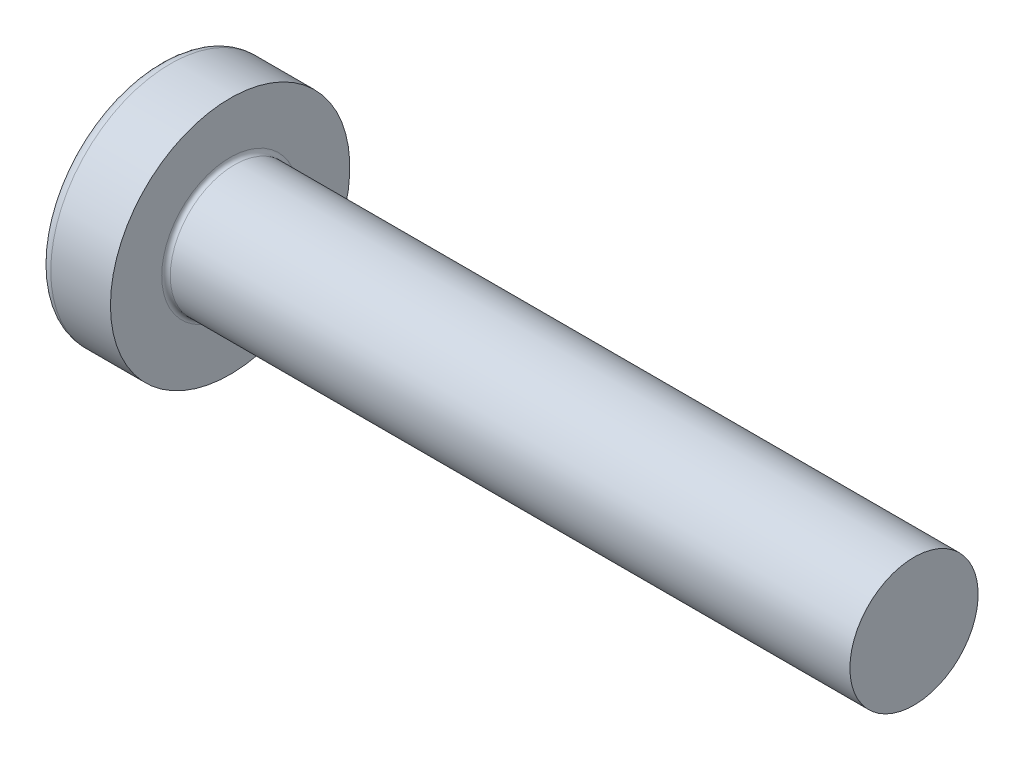
ISO-10303-21;
HEADER;
FILE_DESCRIPTION(('STEP AP214'),'2;1');
FILE_NAME('part.step','',(''),(''),'','','');
FILE_SCHEMA(('AUTOMOTIVE_DESIGN { 1 0 10303 214 1 1 1 1 }'));
ENDSEC;
DATA;
#1=APPLICATION_CONTEXT('core data for automotive mechanical design processes');
#2=APPLICATION_PROTOCOL_DEFINITION('international standard','automotive_design',2000,#1);
#3=PRODUCT_CONTEXT('',#1,'mechanical');
#4=PRODUCT('Part','Part','',(#3));
#5=PRODUCT_RELATED_PRODUCT_CATEGORY('part','',(#4));
#6=PRODUCT_DEFINITION_FORMATION('','',#4);
#7=PRODUCT_DEFINITION_CONTEXT('part definition',#1,'design');
#8=PRODUCT_DEFINITION('design','',#6,#7);
#9=PRODUCT_DEFINITION_SHAPE('','',#8);
#10=(LENGTH_UNIT() NAMED_UNIT(*) SI_UNIT(.MILLI.,.METRE.));
#11=(NAMED_UNIT(*) PLANE_ANGLE_UNIT() SI_UNIT($,.RADIAN.));
#12=(NAMED_UNIT(*) SI_UNIT($,.STERADIAN.) SOLID_ANGLE_UNIT());
#13=UNCERTAINTY_MEASURE_WITH_UNIT(LENGTH_MEASURE(1.E-05),#10,'distance_accuracy_value','');
#14=(GEOMETRIC_REPRESENTATION_CONTEXT(3) GLOBAL_UNCERTAINTY_ASSIGNED_CONTEXT((#13)) GLOBAL_UNIT_ASSIGNED_CONTEXT((#10,
#11,#12)) REPRESENTATION_CONTEXT('',''));
#15=CARTESIAN_POINT('',(0.,0.,0.));
#16=DIRECTION('',(0.,0.,1.));
#17=DIRECTION('',(1.,0.,0.));
#18=AXIS2_PLACEMENT_3D('',#15,#16,#17);
#19=CARTESIAN_POINT('',(5.,0.,0.));
#20=DIRECTION('',(-1.,0.,0.));
#21=DIRECTION('',(0.,1.,0.));
#22=AXIS2_PLACEMENT_3D('',#19,#20,#21);
#23=SPHERICAL_SURFACE('',#22,5.);
#24=CARTESIAN_POINT('',(0.775371598933733,0.,0.));
#25=DIRECTION('',(-1.,0.,0.));
#26=DIRECTION('',(0.,0.,1.));
#27=AXIS2_PLACEMENT_3D('',#24,#25,#26);
#28=CIRCLE('',#27,2.67441860465116);
#29=CARTESIAN_POINT('',(0.775371598933733,0.,2.67441860465116));
#30=VERTEX_POINT('',#29);
#31=EDGE_CURVE('E238',#30,#30,#28,.T.);
#32=ORIENTED_EDGE('',*,*,#31,.T.);
#33=EDGE_LOOP('',(#32));
#34=FACE_BOUND('',#33,.T.);
#35=CARTESIAN_POINT('',(0.0457951200896417,0.,0.));
#36=DIRECTION('',(1.,0.,0.));
#37=DIRECTION('',(0.,0.,-1.));
#38=AXIS2_PLACEMENT_3D('',#35,#36,#37);
#39=CIRCLE('',#38,0.675169614150692);
#40=CARTESIAN_POINT('',(0.0457951200896426,-0.369999999999998,-0.564760133040918));
#41=VERTEX_POINT('',#40);
#42=CARTESIAN_POINT('',(0.0457951200896417,-0.564760133040915,-0.37));
#43=VERTEX_POINT('',#42);
#44=EDGE_CURVE('E374',#41,#43,#39,.F.);
#45=ORIENTED_EDGE('',*,*,#44,.F.);
#46=CARTESIAN_POINT('',(5.,-0.37,0.));
#47=DIRECTION('',(0.,1.,0.));
#48=DIRECTION('',(0.,0.,1.));
#49=AXIS2_PLACEMENT_3D('',#46,#47,#48);
#50=CIRCLE('',#49,4.98629120689917);
#51=CARTESIAN_POINT('',(0.187869734228639,-0.369999999999995,-1.30633162146802));
#52=VERTEX_POINT('',#51);
#53=EDGE_CURVE('E300',#52,#41,#50,.T.);
#54=ORIENTED_EDGE('',*,*,#53,.F.);
#55=CARTESIAN_POINT('',(4.56358262530798,0.,0.875317983305919));
#56=DIRECTION('',(0.446197753347436,0.,-0.894934391398443));
#57=DIRECTION('',(-0.894934391398443,0.,-0.446197753347436));
#58=AXIS2_PLACEMENT_3D('',#55,#56,#57);
#59=CIRCLE('',#58,4.90340272700175);
#60=CARTESIAN_POINT('',(0.18786973422864,0.370000000000005,-1.30633162146802));
#61=VERTEX_POINT('',#60);
#62=EDGE_CURVE('E272',#52,#61,#59,.T.);
#63=ORIENTED_EDGE('',*,*,#62,.T.);
#64=CARTESIAN_POINT('',(5.,0.37,0.));
#65=DIRECTION('',(0.,-1.,0.));
#66=DIRECTION('',(0.,0.,-1.));
#67=AXIS2_PLACEMENT_3D('',#64,#65,#66);
#68=CIRCLE('',#67,4.98629120689917);
#69=CARTESIAN_POINT('',(0.0457951200896425,0.370000000000002,-0.564760133040916));
#70=VERTEX_POINT('',#69);
#71=EDGE_CURVE('E327',#70,#61,#68,.T.);
#72=ORIENTED_EDGE('',*,*,#71,.F.);
#73=CARTESIAN_POINT('',(0.0457951200896417,0.564760133040916,-0.37));
#74=VERTEX_POINT('',#73);
#75=EDGE_CURVE('E393',#74,#70,#39,.F.);
#76=ORIENTED_EDGE('',*,*,#75,.F.);
#77=CARTESIAN_POINT('',(5.,0.,-0.37));
#78=DIRECTION('',(0.,0.,1.));
#79=DIRECTION('',(1.,0.,0.));
#80=AXIS2_PLACEMENT_3D('',#77,#78,#79);
#81=CIRCLE('',#80,4.98629120689917);
#82=CARTESIAN_POINT('',(0.18786973422864,1.30633162146802,-0.37));
#83=VERTEX_POINT('',#82);
#84=EDGE_CURVE('E266',#83,#74,#81,.T.);
#85=ORIENTED_EDGE('',*,*,#84,.F.);
#86=CARTESIAN_POINT('',(4.56358262530798,-0.87531798330592,0.));
#87=DIRECTION('',(0.446197753347436,0.894934391398443,0.));
#88=DIRECTION('',(-0.894934391398442,0.446197753347436,0.));
#89=AXIS2_PLACEMENT_3D('',#86,#87,#88);
#90=CIRCLE('',#89,4.90340272700175);
#91=CARTESIAN_POINT('',(0.18786973422864,1.30633162146802,0.37));
#92=VERTEX_POINT('',#91);
#93=EDGE_CURVE('E269',#83,#92,#90,.T.);
#94=ORIENTED_EDGE('',*,*,#93,.T.);
#95=CARTESIAN_POINT('',(5.,0.,0.37));
#96=DIRECTION('',(0.,0.,-1.));
#97=DIRECTION('',(0.,1.,0.));
#98=AXIS2_PLACEMENT_3D('',#95,#96,#97);
#99=CIRCLE('',#98,4.98629120689917);
#100=CARTESIAN_POINT('',(0.0457951200896417,0.564760133040916,0.37));
#101=VERTEX_POINT('',#100);
#102=EDGE_CURVE('E262',#101,#92,#99,.T.);
#103=ORIENTED_EDGE('',*,*,#102,.F.);
#104=CARTESIAN_POINT('',(0.0457951200896434,0.369999999999998,0.564760133040918));
#105=VERTEX_POINT('',#104);
#106=EDGE_CURVE('E392',#105,#101,#39,.F.);
#107=ORIENTED_EDGE('',*,*,#106,.F.);
#108=CARTESIAN_POINT('',(0.18786973422864,0.369999999999995,1.30633162146802));
#109=VERTEX_POINT('',#108);
#110=EDGE_CURVE('E282',#109,#105,#68,.T.);
#111=ORIENTED_EDGE('',*,*,#110,.F.);
#112=CARTESIAN_POINT('',(4.56358262530798,0.,-0.87531798330592));
#113=DIRECTION('',(0.446197753347436,0.,0.894934391398443));
#114=DIRECTION('',(0.894934391398442,0.,-0.446197753347436));
#115=AXIS2_PLACEMENT_3D('',#112,#113,#114);
#116=CIRCLE('',#115,4.90340272700175);
#117=CARTESIAN_POINT('',(0.18786973422864,-0.370000000000005,1.30633162146802));
#118=VERTEX_POINT('',#117);
#119=EDGE_CURVE('E49',#109,#118,#116,.T.);
#120=ORIENTED_EDGE('',*,*,#119,.T.);
#121=CARTESIAN_POINT('',(0.0457951200896421,-0.370000000000002,0.564760133040916));
#122=VERTEX_POINT('',#121);
#123=EDGE_CURVE('E279',#122,#118,#50,.T.);
#124=ORIENTED_EDGE('',*,*,#123,.F.);
#125=CARTESIAN_POINT('',(0.0457951200896417,-0.564760133040916,0.37));
#126=VERTEX_POINT('',#125);
#127=EDGE_CURVE('E432',#126,#122,#39,.F.);
#128=ORIENTED_EDGE('',*,*,#127,.F.);
#129=CARTESIAN_POINT('',(0.187869734228639,-1.30633162146802,0.37));
#130=VERTEX_POINT('',#129);
#131=EDGE_CURVE('E263',#130,#126,#99,.T.);
#132=ORIENTED_EDGE('',*,*,#131,.F.);
#133=CARTESIAN_POINT('',(4.56358262530798,0.875317983305919,0.));
#134=DIRECTION('',(0.446197753347436,-0.894934391398443,0.));
#135=DIRECTION('',(0.894934391398443,0.446197753347436,0.));
#136=AXIS2_PLACEMENT_3D('',#133,#134,#135);
#137=CIRCLE('',#136,4.90340272700175);
#138=CARTESIAN_POINT('',(0.18786973422864,-1.30633162146802,-0.37));
#139=VERTEX_POINT('',#138);
#140=EDGE_CURVE('E259',#130,#139,#137,.T.);
#141=ORIENTED_EDGE('',*,*,#140,.T.);
#142=EDGE_CURVE('E64',#43,#139,#81,.T.);
#143=ORIENTED_EDGE('',*,*,#142,.F.);
#144=EDGE_LOOP('',(#45,#54,#63,#72,#76,#85,#94,#103,#107,#111,#120,#124,#128,#132,#141,#143));
#145=FACE_BOUND('',#144,.T.);
#146=ADVANCED_FACE('F35',(#34,#145),#23,.T.);
#147=CARTESIAN_POINT('',(1.75,0.527482331818931,-0.37));
#148=DIRECTION('',(0.,0.,1.));
#149=DIRECTION('',(1.,0.,0.));
#150=AXIS2_PLACEMENT_3D('',#147,#148,#149);
#151=PLANE('',#150);
#152=ORIENTED_EDGE('',*,*,#84,.T.);
#153=CARTESIAN_POINT('',(-0.987293237053716,0.649401255967161,-0.37));
#154=CARTESIAN_POINT('',(-0.781914975317084,0.632865887002871,-0.37));
#155=CARTESIAN_POINT('',(-0.576547882393372,0.616188977635081,-0.37));
#156=CARTESIAN_POINT('',(-0.165841599226327,0.582441031964227,-0.37));
#157=CARTESIAN_POINT('',(0.0394975903090452,0.56536998705488,-0.37));
#158=CARTESIAN_POINT('',(0.450133475422572,0.530723441326535,-0.37));
#159=CARTESIAN_POINT('',(0.655430171010573,0.513147940624557,-0.37));
#160=CARTESIAN_POINT('',(1.06596140177934,0.477314957985794,-0.37));
#161=CARTESIAN_POINT('',(1.2711959378071,0.459057485806066,-0.37));
#162=CARTESIAN_POINT('',(1.61065292365626,0.428051938688768,-0.37));
#163=CARTESIAN_POINT('',(1.74490059995643,0.415580824990931,-0.37));
#164=CARTESIAN_POINT('',(2.01334321762763,0.390092023404979,-0.37));
#165=CARTESIAN_POINT('',(2.14753815934577,0.377074339177353,-0.37));
#166=CARTESIAN_POINT('',(2.41586354151957,0.350315629452843,-0.37));
#167=CARTESIAN_POINT('',(2.5499939784531,0.33657456817765,-0.37));
#168=CARTESIAN_POINT('',(2.81814173295471,0.308004077741875,-0.37));
#169=CARTESIAN_POINT('',(2.95215904765134,0.293174621747065,-0.37));
#170=CARTESIAN_POINT('',(3.0860955068368,0.277618485071816,-0.37));
#171=B_SPLINE_CURVE_WITH_KNOTS('',3,(#153,#154,#155,#156,#157,#158,#159,#160,#161,#162,#163,
#164,#165,#166,#167,#168,#169,#170),.UNSPECIFIED.,.F.,.F.,(4,2,2,2,2,2,2,2,4),(0.,
0.618128793984691,1.23627109812525,1.85441325887562,2.4725465791681,2.87702276218609,
3.28149623678161,3.68598973550942,4.09049321032311),.UNSPECIFIED.);
#172=CARTESIAN_POINT('',(1.75,0.415013252800437,-0.37));
#173=VERTEX_POINT('',#172);
#174=EDGE_CURVE('E416',#74,#173,#171,.T.);
#175=ORIENTED_EDGE('',*,*,#174,.T.);
#176=DIRECTION('',(0.,1.,0.));
#177=VECTOR('',#176,1.);
#178=CARTESIAN_POINT('',(1.75,-0.527482331818931,-0.37));
#179=LINE('',#178,#177);
#180=CARTESIAN_POINT('',(1.75,0.527482331818931,-0.37));
#181=VERTEX_POINT('',#180);
#182=EDGE_CURVE('E356',#173,#181,#179,.T.);
#183=ORIENTED_EDGE('',*,*,#182,.T.);
#184=DIRECTION('',(0.894934391398442,-0.446197753347436,0.));
#185=VECTOR('',#184,1.);
#186=CARTESIAN_POINT('',(0.,1.4,-0.37));
#187=LINE('',#186,#185);
#188=EDGE_CURVE('E239',#83,#181,#187,.T.);
#189=ORIENTED_EDGE('',*,*,#188,.F.);
#190=EDGE_LOOP('',(#152,#175,#183,#189));
#191=FACE_BOUND('',#190,.T.);
#192=ADVANCED_FACE('F194',(#191),#151,.T.);
#193=CARTESIAN_POINT('',(1.75,-0.527482331818931,-0.37));
#194=VERTEX_POINT('',#193);
#195=CARTESIAN_POINT('',(1.75,-0.415013252800437,-0.37));
#196=VERTEX_POINT('',#195);
#197=EDGE_CURVE('E247',#194,#196,#179,.T.);
#198=ORIENTED_EDGE('',*,*,#197,.T.);
#199=CARTESIAN_POINT('',(-0.987293237053716,-0.649401255967161,-0.37));
#200=CARTESIAN_POINT('',(-0.781914975317084,-0.632865887002871,-0.37));
#201=CARTESIAN_POINT('',(-0.576547882393372,-0.616188977635081,-0.37));
#202=CARTESIAN_POINT('',(-0.165841599226327,-0.582441031964227,-0.37));
#203=CARTESIAN_POINT('',(0.0394975903090452,-0.56536998705488,-0.37));
#204=CARTESIAN_POINT('',(0.450133475422572,-0.530723441326535,-0.37));
#205=CARTESIAN_POINT('',(0.655430171010573,-0.513147940624557,-0.37));
#206=CARTESIAN_POINT('',(1.06596140177934,-0.477314957985794,-0.37));
#207=CARTESIAN_POINT('',(1.2711959378071,-0.459057485806066,-0.37));
#208=CARTESIAN_POINT('',(1.61065292365626,-0.428051938688768,-0.37));
#209=CARTESIAN_POINT('',(1.74490059995643,-0.415580824990931,-0.37));
#210=CARTESIAN_POINT('',(2.01334321762763,-0.390092023404979,-0.37));
#211=CARTESIAN_POINT('',(2.14753815934577,-0.377074339177353,-0.37));
#212=CARTESIAN_POINT('',(2.41586354151957,-0.350315629452843,-0.37));
#213=CARTESIAN_POINT('',(2.5499939784531,-0.33657456817765,-0.37));
#214=CARTESIAN_POINT('',(2.81814173295471,-0.308004077741875,-0.37));
#215=CARTESIAN_POINT('',(2.95215904765134,-0.293174621747065,-0.37));
#216=CARTESIAN_POINT('',(3.0860955068368,-0.277618485071816,-0.37));
#217=B_SPLINE_CURVE_WITH_KNOTS('',3,(#199,#200,#201,#202,#203,#204,#205,#206,#207,#208,#209,
#210,#211,#212,#213,#214,#215,#216),.UNSPECIFIED.,.F.,.F.,(4,2,2,2,2,2,2,2,4),(0.,
0.618128793984691,1.23627109812525,1.85441325887562,2.4725465791681,2.87702276218609,
3.28149623678161,3.68598973550942,4.09049321032311),.UNSPECIFIED.);
#218=EDGE_CURVE('E391',#196,#43,#217,.F.);
#219=ORIENTED_EDGE('',*,*,#218,.T.);
#220=ORIENTED_EDGE('',*,*,#142,.T.);
#221=DIRECTION('',(0.894934391398442,0.446197753347436,0.));
#222=VECTOR('',#221,1.);
#223=CARTESIAN_POINT('',(0.,-1.4,-0.37));
#224=LINE('',#223,#222);
#225=EDGE_CURVE('E330',#139,#194,#224,.T.);
#226=ORIENTED_EDGE('',*,*,#225,.T.);
#227=EDGE_LOOP('',(#198,#219,#220,#226));
#228=FACE_BOUND('',#227,.T.);
#229=ADVANCED_FACE('F200',(#228),#151,.T.);
#230=CARTESIAN_POINT('',(1.75,-0.527482331818931,0.37));
#231=DIRECTION('',(0.,0.,-1.));
#232=DIRECTION('',(0.,1.,0.));
#233=AXIS2_PLACEMENT_3D('',#230,#231,#232);
#234=PLANE('',#233);
#235=DIRECTION('',(0.,-1.,0.));
#236=VECTOR('',#235,1.);
#237=CARTESIAN_POINT('',(1.75,0.527482331818931,0.37));
#238=LINE('',#237,#236);
#239=CARTESIAN_POINT('',(1.75,0.527482331818931,0.37));
#240=VERTEX_POINT('',#239);
#241=CARTESIAN_POINT('',(1.75,0.415013252800437,0.37));
#242=VERTEX_POINT('',#241);
#243=EDGE_CURVE('E339',#240,#242,#238,.T.);
#244=ORIENTED_EDGE('',*,*,#243,.T.);
#245=CARTESIAN_POINT('',(-0.987293237069635,0.649401255968442,0.37));
#246=CARTESIAN_POINT('',(-0.781914975331301,0.632865887004023,0.37));
#247=CARTESIAN_POINT('',(-0.576547882405888,0.616188977636102,0.37));
#248=CARTESIAN_POINT('',(-0.16584159923544,0.582441031964983,0.37));
#249=CARTESIAN_POINT('',(0.0394975903016338,0.5653699870555,0.37));
#250=CARTESIAN_POINT('',(0.450133475420601,0.530723441326706,0.37));
#251=CARTESIAN_POINT('',(0.655430171012341,0.513147940624409,0.37));
#252=CARTESIAN_POINT('',(1.06596140178858,0.477314957984981,0.37));
#253=CARTESIAN_POINT('',(1.27119593782008,0.459057485804908,0.37));
#254=CARTESIAN_POINT('',(1.61065292367297,0.428051938687225,0.37));
#255=CARTESIAN_POINT('',(1.74490059997313,0.415580824989367,0.37));
#256=CARTESIAN_POINT('',(2.01334321764434,0.39009202340337,0.37));
#257=CARTESIAN_POINT('',(2.14753815936247,0.377074339175718,0.37));
#258=CARTESIAN_POINT('',(2.41586354153627,0.350315629451146,0.37));
#259=CARTESIAN_POINT('',(2.54999397846979,0.336574568175918,0.37));
#260=CARTESIAN_POINT('',(2.8181417329714,0.308004077740054,0.37));
#261=CARTESIAN_POINT('',(2.95215904766802,0.29317462174519,0.37));
#262=CARTESIAN_POINT('',(3.08609550685347,0.277618485069873,0.37));
#263=B_SPLINE_CURVE_WITH_KNOTS('',3,(#245,#246,#247,#248,#249,#250,#251,#252,#253,#254,#255,
#256,#257,#258,#259,#260,#261,#262),.UNSPECIFIED.,.F.,.F.,(4,2,2,2,2,2,2,2,4),(0.,
0.61812879398981,1.23627109813549,1.85441325889711,2.47254657920086,2.87702276221884,
3.28149623681436,3.68598973554218,4.09049321035586),.UNSPECIFIED.);
#264=EDGE_CURVE('E671',#242,#101,#263,.F.);
#265=ORIENTED_EDGE('',*,*,#264,.T.);
#266=ORIENTED_EDGE('',*,*,#102,.T.);
#267=DIRECTION('',(0.894934391398442,-0.446197753347436,0.));
#268=VECTOR('',#267,1.);
#269=CARTESIAN_POINT('',(0.,1.4,0.37));
#270=LINE('',#269,#268);
#271=EDGE_CURVE('E244',#92,#240,#270,.T.);
#272=ORIENTED_EDGE('',*,*,#271,.T.);
#273=EDGE_LOOP('',(#244,#265,#266,#272));
#274=FACE_BOUND('',#273,.T.);
#275=ADVANCED_FACE('F412',(#274),#234,.T.);
#276=ORIENTED_EDGE('',*,*,#131,.T.);
#277=CARTESIAN_POINT('',(-0.987293237069635,-0.649401255968442,0.37));
#278=CARTESIAN_POINT('',(-0.781914975331301,-0.632865887004023,0.37));
#279=CARTESIAN_POINT('',(-0.576547882405888,-0.616188977636102,0.37));
#280=CARTESIAN_POINT('',(-0.16584159923544,-0.582441031964983,0.37));
#281=CARTESIAN_POINT('',(0.0394975903016338,-0.5653699870555,0.37));
#282=CARTESIAN_POINT('',(0.450133475420601,-0.530723441326706,0.37));
#283=CARTESIAN_POINT('',(0.655430171012341,-0.513147940624409,0.37));
#284=CARTESIAN_POINT('',(1.06596140178858,-0.477314957984981,0.37));
#285=CARTESIAN_POINT('',(1.27119593782008,-0.459057485804908,0.37));
#286=CARTESIAN_POINT('',(1.61065292367297,-0.428051938687225,0.37));
#287=CARTESIAN_POINT('',(1.74490059997313,-0.415580824989367,0.37));
#288=CARTESIAN_POINT('',(2.01334321764434,-0.390092023403371,0.37));
#289=CARTESIAN_POINT('',(2.14753815936247,-0.377074339175718,0.37));
#290=CARTESIAN_POINT('',(2.41586354153627,-0.350315629451146,0.37));
#291=CARTESIAN_POINT('',(2.54999397846979,-0.336574568175918,0.37));
#292=CARTESIAN_POINT('',(2.8181417329714,-0.308004077740054,0.37));
#293=CARTESIAN_POINT('',(2.95215904766802,-0.29317462174519,0.37));
#294=CARTESIAN_POINT('',(3.08609550685347,-0.277618485069873,0.37));
#295=B_SPLINE_CURVE_WITH_KNOTS('',3,(#277,#278,#279,#280,#281,#282,#283,#284,#285,#286,#287,
#288,#289,#290,#291,#292,#293,#294),.UNSPECIFIED.,.F.,.F.,(4,2,2,2,2,2,2,2,4),(0.,
0.61812879398981,1.23627109813549,1.85441325889711,2.47254657920086,2.87702276221884,
3.28149623681436,3.68598973554218,4.09049321035586),.UNSPECIFIED.);
#296=CARTESIAN_POINT('',(1.75,-0.415013252800437,0.37));
#297=VERTEX_POINT('',#296);
#298=EDGE_CURVE('E433',#126,#297,#295,.T.);
#299=ORIENTED_EDGE('',*,*,#298,.T.);
#300=CARTESIAN_POINT('',(1.75,-0.527482331818932,0.37));
#301=VERTEX_POINT('',#300);
#302=EDGE_CURVE('E341',#297,#301,#238,.T.);
#303=ORIENTED_EDGE('',*,*,#302,.T.);
#304=DIRECTION('',(0.894934391398443,0.446197753347436,0.));
#305=VECTOR('',#304,1.);
#306=CARTESIAN_POINT('',(0.,-1.4,0.37));
#307=LINE('',#306,#305);
#308=EDGE_CURVE('E332',#130,#301,#307,.T.);
#309=ORIENTED_EDGE('',*,*,#308,.F.);
#310=EDGE_LOOP('',(#276,#299,#303,#309));
#311=FACE_BOUND('',#310,.T.);
#312=ADVANCED_FACE('F519',(#311),#234,.T.);
#313=CARTESIAN_POINT('',(1.75,0.527482331818931,0.37));
#314=DIRECTION('',(0.446197753347436,0.894934391398443,0.));
#315=DIRECTION('',(-0.894934391398442,0.446197753347436,0.));
#316=AXIS2_PLACEMENT_3D('',#313,#314,#315);
#317=PLANE('',#316);
#318=CARTESIAN_POINT('',(2.6696526882832,0.0689604923233249,0.));
#319=DIRECTION('',(0.446197753347436,0.894934391398443,0.));
#320=DIRECTION('',(-0.894934391398443,0.446197753347436,0.));
#321=AXIS2_PLACEMENT_3D('',#318,#319,#320);
#322=ELLIPSE('',#321,1.10195897609154,0.486831694838766);
#323=CARTESIAN_POINT('',(1.75,0.527482331818932,0.175779377683682));
#324=VERTEX_POINT('',#323);
#325=CARTESIAN_POINT('',(1.75,0.527482331818932,-0.175779377683682));
#326=VERTEX_POINT('',#325);
#327=EDGE_CURVE('E305',#324,#326,#322,.F.);
#328=ORIENTED_EDGE('',*,*,#327,.F.);
#329=DIRECTION('',(0.,0.,-1.));
#330=VECTOR('',#329,1.);
#331=CARTESIAN_POINT('',(1.75,0.527482331818931,0.37));
#332=LINE('',#331,#330);
#333=EDGE_CURVE('E342',#240,#324,#332,.T.);
#334=ORIENTED_EDGE('',*,*,#333,.F.);
#335=ORIENTED_EDGE('',*,*,#271,.F.);
#336=ORIENTED_EDGE('',*,*,#93,.F.);
#337=ORIENTED_EDGE('',*,*,#188,.T.);
#338=EDGE_CURVE('E344',#326,#181,#332,.T.);
#339=ORIENTED_EDGE('',*,*,#338,.F.);
#340=EDGE_LOOP('',(#328,#334,#335,#336,#337,#339));
#341=FACE_BOUND('',#340,.T.);
#342=ADVANCED_FACE('F410',(#341),#317,.F.);
#343=CARTESIAN_POINT('',(0.,-1.4,-0.37));
#344=DIRECTION('',(0.446197753347436,-0.894934391398443,0.));
#345=DIRECTION('',(0.894934391398443,0.446197753347436,0.));
#346=AXIS2_PLACEMENT_3D('',#343,#344,#345);
#347=PLANE('',#346);
#348=CARTESIAN_POINT('',(2.6696526882832,-0.0689604923233252,0.));
#349=DIRECTION('',(0.446197753347436,-0.894934391398443,0.));
#350=DIRECTION('',(-0.894934391398443,-0.446197753347436,0.));
#351=AXIS2_PLACEMENT_3D('',#348,#349,#350);
#352=ELLIPSE('',#351,1.10195897609154,0.486831694838766);
#353=CARTESIAN_POINT('',(1.75,-0.527482331818932,-0.175779377683681));
#354=VERTEX_POINT('',#353);
#355=CARTESIAN_POINT('',(1.75,-0.527482331818932,0.175779377683681));
#356=VERTEX_POINT('',#355);
#357=EDGE_CURVE('E673',#354,#356,#352,.F.);
#358=ORIENTED_EDGE('',*,*,#357,.F.);
#359=DIRECTION('',(0.,0.,1.));
#360=VECTOR('',#359,1.);
#361=CARTESIAN_POINT('',(1.75,-0.527482331818931,-0.37));
#362=LINE('',#361,#360);
#363=EDGE_CURVE('E335',#194,#354,#362,.T.);
#364=ORIENTED_EDGE('',*,*,#363,.F.);
#365=ORIENTED_EDGE('',*,*,#225,.F.);
#366=ORIENTED_EDGE('',*,*,#140,.F.);
#367=ORIENTED_EDGE('',*,*,#308,.T.);
#368=EDGE_CURVE('E338',#356,#301,#362,.T.);
#369=ORIENTED_EDGE('',*,*,#368,.F.);
#370=EDGE_LOOP('',(#358,#364,#365,#366,#367,#369));
#371=FACE_BOUND('',#370,.T.);
#372=ADVANCED_FACE('F506',(#371),#347,.F.);
#373=CARTESIAN_POINT('',(1.75,0.527482331818931,-0.37));
#374=DIRECTION('',(-1.,0.,0.));
#375=DIRECTION('',(0.,0.,1.));
#376=AXIS2_PLACEMENT_3D('',#373,#374,#375);
#377=PLANE('',#376);
#378=DIRECTION('',(0.,1.,0.));
#379=VECTOR('',#378,1.);
#380=CARTESIAN_POINT('',(1.75,-0.370000000000002,0.52748233181893));
#381=LINE('',#380,#379);
#382=CARTESIAN_POINT('',(1.75,-0.370000000000002,0.52748233181893));
#383=VERTEX_POINT('',#382);
#384=CARTESIAN_POINT('',(1.75,-0.175779377683686,0.52748233181893));
#385=VERTEX_POINT('',#384);
#386=EDGE_CURVE('E320',#383,#385,#381,.T.);
#387=ORIENTED_EDGE('',*,*,#386,.T.);
#388=CARTESIAN_POINT('',(1.75,0.,0.));
#389=DIRECTION('',(-1.,0.,0.));
#390=DIRECTION('',(0.,0.,1.));
#391=AXIS2_PLACEMENT_3D('',#388,#389,#390);
#392=CIRCLE('',#391,0.556);
#393=CARTESIAN_POINT('',(1.75,-0.370000000000001,0.415013252800436));
#394=VERTEX_POINT('',#393);
#395=EDGE_CURVE('E701',#394,#385,#392,.T.);
#396=ORIENTED_EDGE('',*,*,#395,.F.);
#397=DIRECTION('',(0.,0.,-1.));
#398=VECTOR('',#397,1.);
#399=CARTESIAN_POINT('',(1.75,-0.370000000000002,0.52748233181893));
#400=LINE('',#399,#398);
#401=EDGE_CURVE('E316',#383,#394,#400,.T.);
#402=ORIENTED_EDGE('',*,*,#401,.F.);
#403=EDGE_LOOP('',(#387,#396,#402));
#404=FACE_BOUND('',#403,.T.);
#405=ADVANCED_FACE('F499',(#404),#377,.T.);
#406=ORIENTED_EDGE('',*,*,#302,.F.);
#407=EDGE_CURVE('E706',#356,#297,#392,.T.);
#408=ORIENTED_EDGE('',*,*,#407,.F.);
#409=ORIENTED_EDGE('',*,*,#368,.T.);
#410=EDGE_LOOP('',(#406,#408,#409));
#411=FACE_BOUND('',#410,.T.);
#412=ADVANCED_FACE('F492',(#411),#377,.T.);
#413=ORIENTED_EDGE('',*,*,#363,.T.);
#414=EDGE_CURVE('E385',#196,#354,#392,.T.);
#415=ORIENTED_EDGE('',*,*,#414,.F.);
#416=ORIENTED_EDGE('',*,*,#197,.F.);
#417=EDGE_LOOP('',(#413,#415,#416));
#418=FACE_BOUND('',#417,.T.);
#419=ADVANCED_FACE('F486',(#418),#377,.T.);
#420=CARTESIAN_POINT('',(1.75,-0.369999999999998,-0.415013252800438));
#421=VERTEX_POINT('',#420);
#422=CARTESIAN_POINT('',(1.75,-0.369999999999998,-0.527482331818933));
#423=VERTEX_POINT('',#422);
#424=EDGE_CURVE('E319',#421,#423,#400,.T.);
#425=ORIENTED_EDGE('',*,*,#424,.F.);
#426=CARTESIAN_POINT('',(1.75,-0.17577937768368,-0.527482331818932));
#427=VERTEX_POINT('',#426);
#428=EDGE_CURVE('E56',#427,#421,#392,.T.);
#429=ORIENTED_EDGE('',*,*,#428,.F.);
#430=DIRECTION('',(0.,-1.,0.));
#431=VECTOR('',#430,1.);
#432=CARTESIAN_POINT('',(1.75,0.370000000000002,-0.52748233181893));
#433=LINE('',#432,#431);
#434=EDGE_CURVE('E315',#427,#423,#433,.T.);
#435=ORIENTED_EDGE('',*,*,#434,.T.);
#436=EDGE_LOOP('',(#425,#429,#435));
#437=FACE_BOUND('',#436,.T.);
#438=ADVANCED_FACE('F380',(#437),#377,.T.);
#439=CARTESIAN_POINT('',(1.75,0.370000000000002,-0.52748233181893));
#440=VERTEX_POINT('',#439);
#441=CARTESIAN_POINT('',(1.75,0.175779377683684,-0.527482331818931));
#442=VERTEX_POINT('',#441);
#443=EDGE_CURVE('E312',#440,#442,#433,.T.);
#444=ORIENTED_EDGE('',*,*,#443,.T.);
#445=CARTESIAN_POINT('',(1.75,0.370000000000001,-0.415013252800436));
#446=VERTEX_POINT('',#445);
#447=EDGE_CURVE('E384',#446,#442,#392,.T.);
#448=ORIENTED_EDGE('',*,*,#447,.F.);
#449=DIRECTION('',(0.,0.,1.));
#450=VECTOR('',#449,1.);
#451=CARTESIAN_POINT('',(1.75,0.370000000000002,-0.52748233181893));
#452=LINE('',#451,#450);
#453=EDGE_CURVE('E324',#440,#446,#452,.T.);
#454=ORIENTED_EDGE('',*,*,#453,.F.);
#455=EDGE_LOOP('',(#444,#448,#454));
#456=FACE_BOUND('',#455,.T.);
#457=ADVANCED_FACE('F474',(#456),#377,.T.);
#458=ORIENTED_EDGE('',*,*,#182,.F.);
#459=EDGE_CURVE('E690',#326,#173,#392,.T.);
#460=ORIENTED_EDGE('',*,*,#459,.F.);
#461=ORIENTED_EDGE('',*,*,#338,.T.);
#462=EDGE_LOOP('',(#458,#460,#461));
#463=FACE_BOUND('',#462,.T.);
#464=ADVANCED_FACE('F467',(#463),#377,.T.);
#465=ORIENTED_EDGE('',*,*,#333,.T.);
#466=EDGE_CURVE('E692',#242,#324,#392,.T.);
#467=ORIENTED_EDGE('',*,*,#466,.F.);
#468=ORIENTED_EDGE('',*,*,#243,.F.);
#469=EDGE_LOOP('',(#465,#467,#468));
#470=FACE_BOUND('',#469,.T.);
#471=ADVANCED_FACE('F461',(#470),#377,.T.);
#472=CARTESIAN_POINT('',(1.75,0.369999999999998,0.527482331818932));
#473=DIRECTION('',(0.,-1.,0.));
#474=DIRECTION('',(1.,0.,0.));
#475=AXIS2_PLACEMENT_3D('',#472,#473,#474);
#476=PLANE('',#475);
#477=ORIENTED_EDGE('',*,*,#110,.T.);
#478=CARTESIAN_POINT('',(-0.987293237069635,0.369999999999998,0.649401255968443));
#479=CARTESIAN_POINT('',(-0.781914975331301,0.369999999999998,0.632865887004024));
#480=CARTESIAN_POINT('',(-0.576547882405888,0.369999999999998,0.616188977636103));
#481=CARTESIAN_POINT('',(-0.16584159923544,0.369999999999998,0.582441031964984));
#482=CARTESIAN_POINT('',(0.0394975903016338,0.369999999999998,0.565369987055501));
#483=CARTESIAN_POINT('',(0.450133475420601,0.369999999999998,0.530723441326707));
#484=CARTESIAN_POINT('',(0.655430171012341,0.369999999999998,0.51314794062441));
#485=CARTESIAN_POINT('',(1.06596140178858,0.369999999999998,0.477314957984982));
#486=CARTESIAN_POINT('',(1.27119593782008,0.369999999999998,0.459057485804909));
#487=CARTESIAN_POINT('',(1.61065292367297,0.369999999999999,0.428051938687226));
#488=CARTESIAN_POINT('',(1.74490059997313,0.369999999999999,0.415580824989369));
#489=CARTESIAN_POINT('',(2.01334321764434,0.369999999999999,0.390092023403372));
#490=CARTESIAN_POINT('',(2.14753815936247,0.369999999999999,0.37707433917572));
#491=CARTESIAN_POINT('',(2.41586354153627,0.369999999999999,0.350315629451147));
#492=CARTESIAN_POINT('',(2.54999397846979,0.369999999999999,0.336574568175919));
#493=CARTESIAN_POINT('',(2.8181417329714,0.369999999999999,0.308004077740055));
#494=CARTESIAN_POINT('',(2.95215904766802,0.369999999999999,0.293174621745191));
#495=CARTESIAN_POINT('',(3.08609550685347,0.369999999999999,0.277618485069875));
#496=B_SPLINE_CURVE_WITH_KNOTS('',3,(#478,#479,#480,#481,#482,#483,#484,#485,#486,#487,#488,
#489,#490,#491,#492,#493,#494,#495),.UNSPECIFIED.,.F.,.F.,(4,2,2,2,2,2,2,2,4),(0.,
0.61812879398981,1.23627109813549,1.85441325889711,2.47254657920086,2.87702276221884,
3.28149623681436,3.68598973554218,4.09049321035586),.UNSPECIFIED.);
#497=CARTESIAN_POINT('',(1.75,0.369999999999999,0.415013252800439));
#498=VERTEX_POINT('',#497);
#499=EDGE_CURVE('E670',#105,#498,#496,.T.);
#500=ORIENTED_EDGE('',*,*,#499,.T.);
#501=CARTESIAN_POINT('',(1.75,0.369999999999998,0.527482331818932));
#502=VERTEX_POINT('',#501);
#503=EDGE_CURVE('E297',#498,#502,#452,.T.);
#504=ORIENTED_EDGE('',*,*,#503,.T.);
#505=DIRECTION('',(0.894934391398442,0.,-0.446197753347436));
#506=VECTOR('',#505,1.);
#507=CARTESIAN_POINT('',(0.,0.369999999999995,1.4));
#508=LINE('',#507,#506);
#509=EDGE_CURVE('E290',#109,#502,#508,.T.);
#510=ORIENTED_EDGE('',*,*,#509,.F.);
#511=EDGE_LOOP('',(#477,#500,#504,#510));
#512=FACE_BOUND('',#511,.T.);
#513=ADVANCED_FACE('F294',(#512),#476,.T.);
#514=CARTESIAN_POINT('',(1.75,-0.369999999999998,-0.527482331818933));
#515=DIRECTION('',(0.,1.,0.));
#516=DIRECTION('',(0.,0.,1.));
#517=AXIS2_PLACEMENT_3D('',#514,#515,#516);
#518=PLANE('',#517);
#519=ORIENTED_EDGE('',*,*,#401,.T.);
#520=CARTESIAN_POINT('',(-0.987293237053716,-0.370000000000002,0.649401255967159));
#521=CARTESIAN_POINT('',(-0.781914975317084,-0.370000000000002,0.63286588700287));
#522=CARTESIAN_POINT('',(-0.576547882393372,-0.370000000000002,0.616188977635079));
#523=CARTESIAN_POINT('',(-0.165841599226327,-0.370000000000002,0.582441031964225));
#524=CARTESIAN_POINT('',(0.039497590309045,-0.370000000000002,0.565369987054878));
#525=CARTESIAN_POINT('',(0.450133475422572,-0.370000000000002,0.530723441326534));
#526=CARTESIAN_POINT('',(0.655430171010573,-0.370000000000002,0.513147940624556));
#527=CARTESIAN_POINT('',(1.06596140177934,-0.370000000000002,0.477314957985792));
#528=CARTESIAN_POINT('',(1.2711959378071,-0.370000000000002,0.459057485806065));
#529=CARTESIAN_POINT('',(1.61065292365626,-0.370000000000001,0.428051938688767));
#530=CARTESIAN_POINT('',(1.74490059995642,-0.370000000000001,0.41558082499093));
#531=CARTESIAN_POINT('',(2.01334321762763,-0.370000000000001,0.390092023404978));
#532=CARTESIAN_POINT('',(2.14753815934577,-0.370000000000001,0.377074339177352));
#533=CARTESIAN_POINT('',(2.41586354151957,-0.370000000000001,0.350315629452841));
#534=CARTESIAN_POINT('',(2.5499939784531,-0.370000000000001,0.336574568177649));
#535=CARTESIAN_POINT('',(2.81814173295471,-0.370000000000001,0.308004077741874));
#536=CARTESIAN_POINT('',(2.95215904765134,-0.370000000000001,0.293174621747064));
#537=CARTESIAN_POINT('',(3.0860955068368,-0.370000000000001,0.277618485071814));
#538=B_SPLINE_CURVE_WITH_KNOTS('',3,(#520,#521,#522,#523,#524,#525,#526,#527,#528,#529,#530,
#531,#532,#533,#534,#535,#536,#537),.UNSPECIFIED.,.F.,.F.,(4,2,2,2,2,2,2,2,4),(0.,
0.618128793984691,1.23627109812525,1.85441325887562,2.4725465791681,2.87702276218609,
3.28149623678161,3.68598973550942,4.09049321032311),.UNSPECIFIED.);
#539=EDGE_CURVE('E425',#394,#122,#538,.F.);
#540=ORIENTED_EDGE('',*,*,#539,.T.);
#541=ORIENTED_EDGE('',*,*,#123,.T.);
#542=DIRECTION('',(0.894934391398442,0.,-0.446197753347436));
#543=VECTOR('',#542,1.);
#544=CARTESIAN_POINT('',(0.,-0.370000000000005,1.4));
#545=LINE('',#544,#543);
#546=EDGE_CURVE('E292',#118,#383,#545,.T.);
#547=ORIENTED_EDGE('',*,*,#546,.T.);
#548=EDGE_LOOP('',(#519,#540,#541,#547));
#549=FACE_BOUND('',#548,.T.);
#550=ADVANCED_FACE('F229',(#549),#518,.T.);
#551=CARTESIAN_POINT('',(1.75,-0.370000000000002,0.52748233181893));
#552=DIRECTION('',(0.446197753347436,0.,0.894934391398443));
#553=DIRECTION('',(-0.894934391398442,0.,0.446197753347436));
#554=AXIS2_PLACEMENT_3D('',#551,#552,#553);
#555=PLANE('',#554);
#556=CARTESIAN_POINT('',(2.6696526882832,0.,0.0689604923233248));
#557=DIRECTION('',(0.446197753347436,0.,0.894934391398443));
#558=DIRECTION('',(-0.894934391398443,0.,0.446197753347436));
#559=AXIS2_PLACEMENT_3D('',#556,#557,#558);
#560=ELLIPSE('',#559,1.10195897609154,0.486831694838766);
#561=CARTESIAN_POINT('',(1.75,0.175779377683682,0.527482331818932));
#562=VERTEX_POINT('',#561);
#563=EDGE_CURVE('E423',#385,#562,#560,.F.);
#564=ORIENTED_EDGE('',*,*,#563,.F.);
#565=ORIENTED_EDGE('',*,*,#386,.F.);
#566=ORIENTED_EDGE('',*,*,#546,.F.);
#567=ORIENTED_EDGE('',*,*,#119,.F.);
#568=ORIENTED_EDGE('',*,*,#509,.T.);
#569=EDGE_CURVE('E323',#562,#502,#381,.T.);
#570=ORIENTED_EDGE('',*,*,#569,.F.);
#571=EDGE_LOOP('',(#564,#565,#566,#567,#568,#570));
#572=FACE_BOUND('',#571,.T.);
#573=ADVANCED_FACE('F288',(#572),#555,.F.);
#574=CARTESIAN_POINT('',(0.,0.370000000000005,-1.4));
#575=DIRECTION('',(0.446197753347436,0.,-0.894934391398443));
#576=DIRECTION('',(0.894934391398443,0.,0.446197753347436));
#577=AXIS2_PLACEMENT_3D('',#574,#575,#576);
#578=PLANE('',#577);
#579=CARTESIAN_POINT('',(2.6696526882832,0.,-0.0689604923233253));
#580=DIRECTION('',(0.446197753347436,0.,-0.894934391398443));
#581=DIRECTION('',(-0.894934391398443,0.,-0.446197753347436));
#582=AXIS2_PLACEMENT_3D('',#579,#580,#581);
#583=ELLIPSE('',#582,1.10195897609154,0.486831694838766);
#584=EDGE_CURVE('E378',#442,#427,#583,.F.);
#585=ORIENTED_EDGE('',*,*,#584,.F.);
#586=ORIENTED_EDGE('',*,*,#443,.F.);
#587=DIRECTION('',(0.894934391398442,0.,0.446197753347436));
#588=VECTOR('',#587,1.);
#589=CARTESIAN_POINT('',(0.,0.370000000000005,-1.4));
#590=LINE('',#589,#588);
#591=EDGE_CURVE('E302',#61,#440,#590,.T.);
#592=ORIENTED_EDGE('',*,*,#591,.F.);
#593=ORIENTED_EDGE('',*,*,#62,.F.);
#594=DIRECTION('',(0.894934391398443,0.,0.446197753347436));
#595=VECTOR('',#594,1.);
#596=CARTESIAN_POINT('',(0.,-0.369999999999995,-1.4));
#597=LINE('',#596,#595);
#598=EDGE_CURVE('E309',#52,#423,#597,.T.);
#599=ORIENTED_EDGE('',*,*,#598,.T.);
#600=ORIENTED_EDGE('',*,*,#434,.F.);
#601=EDGE_LOOP('',(#585,#586,#592,#593,#599,#600));
#602=FACE_BOUND('',#601,.T.);
#603=ADVANCED_FACE('F369',(#602),#578,.F.);
#604=ORIENTED_EDGE('',*,*,#453,.T.);
#605=CARTESIAN_POINT('',(-0.987293237053716,0.370000000000002,-0.649401255967159));
#606=CARTESIAN_POINT('',(-0.781914975317084,0.370000000000002,-0.63286588700287));
#607=CARTESIAN_POINT('',(-0.576547882393372,0.370000000000002,-0.61618897763508));
#608=CARTESIAN_POINT('',(-0.165841599226327,0.370000000000002,-0.582441031964225));
#609=CARTESIAN_POINT('',(0.039497590309045,0.370000000000002,-0.565369987054878));
#610=CARTESIAN_POINT('',(0.450133475422572,0.370000000000002,-0.530723441326533));
#611=CARTESIAN_POINT('',(0.655430171010573,0.370000000000002,-0.513147940624555));
#612=CARTESIAN_POINT('',(1.06596140177934,0.370000000000002,-0.477314957985793));
#613=CARTESIAN_POINT('',(1.2711959378071,0.370000000000002,-0.459057485806065));
#614=CARTESIAN_POINT('',(1.61065292365626,0.370000000000001,-0.428051938688767));
#615=CARTESIAN_POINT('',(1.74490059995642,0.370000000000001,-0.41558082499093));
#616=CARTESIAN_POINT('',(2.01334321762763,0.370000000000001,-0.390092023404978));
#617=CARTESIAN_POINT('',(2.14753815934577,0.370000000000001,-0.377074339177352));
#618=CARTESIAN_POINT('',(2.41586354151957,0.370000000000001,-0.350315629452841));
#619=CARTESIAN_POINT('',(2.5499939784531,0.370000000000001,-0.336574568177649));
#620=CARTESIAN_POINT('',(2.81814173295471,0.370000000000001,-0.308004077741874));
#621=CARTESIAN_POINT('',(2.95215904765134,0.370000000000001,-0.293174621747064));
#622=CARTESIAN_POINT('',(3.0860955068368,0.370000000000001,-0.277618485071814));
#623=B_SPLINE_CURVE_WITH_KNOTS('',3,(#605,#606,#607,#608,#609,#610,#611,#612,#613,#614,#615,
#616,#617,#618,#619,#620,#621,#622),.UNSPECIFIED.,.F.,.F.,(4,2,2,2,2,2,2,2,4),(0.,
0.618128793984691,1.23627109812525,1.85441325887562,2.4725465791681,2.87702276218609,
3.28149623678161,3.68598973550942,4.09049321032311),.UNSPECIFIED.);
#624=EDGE_CURVE('E365',#446,#70,#623,.F.);
#625=ORIENTED_EDGE('',*,*,#624,.T.);
#626=ORIENTED_EDGE('',*,*,#71,.T.);
#627=ORIENTED_EDGE('',*,*,#591,.T.);
#628=EDGE_LOOP('',(#604,#625,#626,#627));
#629=FACE_BOUND('',#628,.T.);
#630=ADVANCED_FACE('F227',(#629),#476,.T.);
#631=ORIENTED_EDGE('',*,*,#53,.T.);
#632=CARTESIAN_POINT('',(-0.987293237053716,-0.369999999999998,-0.649401255967162));
#633=CARTESIAN_POINT('',(-0.781914975317084,-0.369999999999998,-0.632865887002873));
#634=CARTESIAN_POINT('',(-0.576547882393372,-0.369999999999998,-0.616188977635082));
#635=CARTESIAN_POINT('',(-0.165841599226327,-0.369999999999998,-0.582441031964228));
#636=CARTESIAN_POINT('',(0.0394975903090453,-0.369999999999998,-0.565369987054881));
#637=CARTESIAN_POINT('',(0.450133475422572,-0.369999999999998,-0.530723441326536));
#638=CARTESIAN_POINT('',(0.655430171010573,-0.369999999999998,-0.513147940624558));
#639=CARTESIAN_POINT('',(1.06596140177934,-0.369999999999998,-0.477314957985795));
#640=CARTESIAN_POINT('',(1.2711959378071,-0.369999999999998,-0.459057485806067));
#641=CARTESIAN_POINT('',(1.61065292365626,-0.369999999999998,-0.42805193868877));
#642=CARTESIAN_POINT('',(1.74490059995643,-0.369999999999998,-0.415580824990932));
#643=CARTESIAN_POINT('',(2.01334321762763,-0.369999999999999,-0.390092023404981));
#644=CARTESIAN_POINT('',(2.14753815934577,-0.369999999999999,-0.377074339177355));
#645=CARTESIAN_POINT('',(2.41586354151957,-0.369999999999999,-0.350315629452844));
#646=CARTESIAN_POINT('',(2.5499939784531,-0.369999999999999,-0.336574568177652));
#647=CARTESIAN_POINT('',(2.81814173295471,-0.369999999999999,-0.308004077741877));
#648=CARTESIAN_POINT('',(2.95215904765134,-0.369999999999999,-0.293174621747066));
#649=CARTESIAN_POINT('',(3.0860955068368,-0.369999999999999,-0.277618485071817));
#650=B_SPLINE_CURVE_WITH_KNOTS('',3,(#632,#633,#634,#635,#636,#637,#638,#639,#640,#641,#642,
#643,#644,#645,#646,#647,#648,#649),.UNSPECIFIED.,.F.,.F.,(4,2,2,2,2,2,2,2,4),(0.,
0.618128793984691,1.23627109812525,1.85441325887562,2.4725465791681,2.87702276218609,
3.28149623678161,3.68598973550942,4.09049321032311),.UNSPECIFIED.);
#651=EDGE_CURVE('E11',#41,#421,#650,.T.);
#652=ORIENTED_EDGE('',*,*,#651,.T.);
#653=ORIENTED_EDGE('',*,*,#424,.T.);
#654=ORIENTED_EDGE('',*,*,#598,.F.);
#655=EDGE_LOOP('',(#631,#652,#653,#654));
#656=FACE_BOUND('',#655,.T.);
#657=ADVANCED_FACE('F222',(#656),#518,.T.);
#658=CARTESIAN_POINT('',(-25.4,0.,0.));
#659=DIRECTION('',(-1.,0.,0.));
#660=DIRECTION('',(0.,0.,1.));
#661=AXIS2_PLACEMENT_3D('',#658,#659,#660);
#662=CYLINDRICAL_SURFACE('',#661,1.5);
#663=CARTESIAN_POINT('',(2.5,0.,0.));
#664=DIRECTION('',(-1.,0.,0.));
#665=DIRECTION('',(0.,0.,1.));
#666=AXIS2_PLACEMENT_3D('',#663,#664,#665);
#667=CIRCLE('',#666,1.5);
#668=CARTESIAN_POINT('',(2.5,0.,1.5));
#669=VERTEX_POINT('',#668);
#670=EDGE_CURVE('E233',#669,#669,#667,.F.);
#671=ORIENTED_EDGE('',*,*,#670,.T.);
#672=EDGE_LOOP('',(#671));
#673=FACE_BOUND('',#672,.T.);
#674=CARTESIAN_POINT('',(18.4,0.,0.));
#675=DIRECTION('',(-1.,0.,0.));
#676=DIRECTION('',(0.,0.,1.));
#677=AXIS2_PLACEMENT_3D('',#674,#675,#676);
#678=CIRCLE('',#677,1.5);
#679=CARTESIAN_POINT('',(18.4,0.,1.5));
#680=VERTEX_POINT('',#679);
#681=EDGE_CURVE('E236',#680,#680,#678,.T.);
#682=ORIENTED_EDGE('',*,*,#681,.T.);
#683=EDGE_LOOP('',(#682));
#684=FACE_BOUND('',#683,.T.);
#685=ADVANCED_FACE('F219',(#673,#684),#662,.T.);
#686=CARTESIAN_POINT('',(2.4,1.5,0.));
#687=DIRECTION('',(-1.,0.,0.));
#688=DIRECTION('',(0.,0.,1.));
#689=AXIS2_PLACEMENT_3D('',#686,#687,#688);
#690=PLANE('',#689);
#691=CARTESIAN_POINT('',(2.4,0.,0.));
#692=DIRECTION('',(-1.,0.,0.));
#693=DIRECTION('',(0.,0.,1.));
#694=AXIS2_PLACEMENT_3D('',#691,#692,#693);
#695=CIRCLE('',#694,1.6);
#696=CARTESIAN_POINT('',(2.4,0.,1.6));
#697=VERTEX_POINT('',#696);
#698=EDGE_CURVE('E255',#697,#697,#695,.T.);
#699=ORIENTED_EDGE('',*,*,#698,.T.);
#700=EDGE_LOOP('',(#699));
#701=FACE_BOUND('',#700,.T.);
#702=CARTESIAN_POINT('',(2.4,0.,0.));
#703=DIRECTION('',(-1.,0.,0.));
#704=DIRECTION('',(0.,0.,1.));
#705=AXIS2_PLACEMENT_3D('',#702,#703,#704);
#706=CIRCLE('',#705,2.8);
#707=CARTESIAN_POINT('',(2.4,0.,2.8));
#708=VERTEX_POINT('',#707);
#709=EDGE_CURVE('E252',#708,#708,#706,.T.);
#710=ORIENTED_EDGE('',*,*,#709,.F.);
#711=EDGE_LOOP('',(#710));
#712=FACE_BOUND('',#711,.T.);
#713=ADVANCED_FACE('F216',(#701,#712),#690,.F.);
#714=CARTESIAN_POINT('',(-25.4,0.,0.));
#715=DIRECTION('',(-1.,0.,0.));
#716=DIRECTION('',(0.,0.,1.));
#717=AXIS2_PLACEMENT_3D('',#714,#715,#716);
#718=CYLINDRICAL_SURFACE('',#717,2.8);
#719=ORIENTED_EDGE('',*,*,#709,.T.);
#720=EDGE_LOOP('',(#719));
#721=FACE_BOUND('',#720,.T.);
#722=CARTESIAN_POINT('',(1.00350153259131,0.,0.));
#723=DIRECTION('',(-1.,0.,0.));
#724=DIRECTION('',(0.,0.,1.));
#725=AXIS2_PLACEMENT_3D('',#722,#723,#724);
#726=CIRCLE('',#725,2.8);
#727=CARTESIAN_POINT('',(1.00350153259131,0.,2.8));
#728=VERTEX_POINT('',#727);
#729=EDGE_CURVE('E241',#728,#728,#726,.T.);
#730=ORIENTED_EDGE('',*,*,#729,.F.);
#731=EDGE_LOOP('',(#730));
#732=FACE_BOUND('',#731,.T.);
#733=ADVANCED_FACE('F212',(#721,#732),#718,.T.);
#734=CARTESIAN_POINT('',(1.00350153259131,0.,0.));
#735=DIRECTION('',(-1.,0.,0.));
#736=DIRECTION('',(0.,0.,1.));
#737=AXIS2_PLACEMENT_3D('',#734,#735,#736);
#738=TOROIDAL_SURFACE('',#737,2.53,0.27);
#739=ORIENTED_EDGE('',*,*,#729,.T.);
#740=EDGE_LOOP('',(#739));
#741=FACE_BOUND('',#740,.T.);
#742=ORIENTED_EDGE('',*,*,#31,.F.);
#743=EDGE_LOOP('',(#742));
#744=FACE_BOUND('',#743,.T.);
#745=ADVANCED_FACE('F209',(#741,#744),#738,.T.);
#746=CARTESIAN_POINT('',(18.4,1.5,0.));
#747=DIRECTION('',(1.,0.,0.));
#748=DIRECTION('',(0.,0.,-1.));
#749=AXIS2_PLACEMENT_3D('',#746,#747,#748);
#750=PLANE('',#749);
#751=ORIENTED_EDGE('',*,*,#681,.F.);
#752=EDGE_LOOP('',(#751));
#753=FACE_BOUND('',#752,.T.);
#754=ADVANCED_FACE('F207',(#753),#750,.T.);
#755=CARTESIAN_POINT('',(2.5,0.,0.));
#756=DIRECTION('',(-1.,0.,0.));
#757=DIRECTION('',(0.,0.,1.));
#758=AXIS2_PLACEMENT_3D('',#755,#756,#757);
#759=TOROIDAL_SURFACE('',#758,1.6,0.1);
#760=ORIENTED_EDGE('',*,*,#670,.F.);
#761=EDGE_LOOP('',(#760));
#762=FACE_BOUND('',#761,.T.);
#763=ORIENTED_EDGE('',*,*,#698,.F.);
#764=EDGE_LOOP('',(#763));
#765=FACE_BOUND('',#764,.T.);
#766=ADVANCED_FACE('F37',(#762,#765),#759,.F.);
#767=ORIENTED_EDGE('',*,*,#503,.F.);
#768=EDGE_CURVE('E386',#562,#498,#392,.T.);
#769=ORIENTED_EDGE('',*,*,#768,.F.);
#770=ORIENTED_EDGE('',*,*,#569,.T.);
#771=EDGE_LOOP('',(#767,#769,#770));
#772=FACE_BOUND('',#771,.T.);
#773=ADVANCED_FACE('F468',(#772),#377,.T.);
#774=CARTESIAN_POINT('',(1.75,0.,0.));
#775=DIRECTION('',(-1.,0.,0.));
#776=DIRECTION('',(0.,0.,1.));
#777=AXIS2_PLACEMENT_3D('',#774,#775,#776);
#778=CONICAL_SURFACE('',#777,0.556,0.0698131700797659);
#779=ORIENTED_EDGE('',*,*,#327,.T.);
#780=EDGE_CURVE('E687',#324,#326,#392,.T.);
#781=ORIENTED_EDGE('',*,*,#780,.F.);
#782=EDGE_LOOP('',(#779,#781));
#783=FACE_BOUND('',#782,.T.);
#784=ADVANCED_FACE('F191',(#783),#778,.F.);
#785=ORIENTED_EDGE('',*,*,#357,.T.);
#786=EDGE_CURVE('E707',#354,#356,#392,.T.);
#787=ORIENTED_EDGE('',*,*,#786,.F.);
#788=EDGE_LOOP('',(#785,#787));
#789=FACE_BOUND('',#788,.T.);
#790=ADVANCED_FACE('F601',(#789),#778,.F.);
#791=EDGE_CURVE('E388',#498,#242,#392,.T.);
#792=ORIENTED_EDGE('',*,*,#791,.F.);
#793=ORIENTED_EDGE('',*,*,#499,.F.);
#794=ORIENTED_EDGE('',*,*,#106,.T.);
#795=ORIENTED_EDGE('',*,*,#264,.F.);
#796=EDGE_LOOP('',(#792,#793,#794,#795));
#797=FACE_BOUND('',#796,.T.);
#798=ADVANCED_FACE('F607',(#797),#778,.F.);
#799=ORIENTED_EDGE('',*,*,#563,.T.);
#800=EDGE_CURVE('E389',#385,#562,#392,.T.);
#801=ORIENTED_EDGE('',*,*,#800,.F.);
#802=EDGE_LOOP('',(#799,#801));
#803=FACE_BOUND('',#802,.T.);
#804=ADVANCED_FACE('F614',(#803),#778,.F.);
#805=ORIENTED_EDGE('',*,*,#584,.T.);
#806=EDGE_CURVE('E381',#442,#427,#392,.T.);
#807=ORIENTED_EDGE('',*,*,#806,.F.);
#808=EDGE_LOOP('',(#805,#807));
#809=FACE_BOUND('',#808,.T.);
#810=ADVANCED_FACE('F621',(#809),#778,.F.);
#811=ORIENTED_EDGE('',*,*,#127,.T.);
#812=ORIENTED_EDGE('',*,*,#539,.F.);
#813=EDGE_CURVE('E703',#297,#394,#392,.T.);
#814=ORIENTED_EDGE('',*,*,#813,.F.);
#815=ORIENTED_EDGE('',*,*,#298,.F.);
#816=EDGE_LOOP('',(#811,#812,#814,#815));
#817=FACE_BOUND('',#816,.T.);
#818=ADVANCED_FACE('F628',(#817),#778,.F.);
#819=ORIENTED_EDGE('',*,*,#75,.T.);
#820=ORIENTED_EDGE('',*,*,#624,.F.);
#821=EDGE_CURVE('E693',#173,#446,#392,.T.);
#822=ORIENTED_EDGE('',*,*,#821,.F.);
#823=ORIENTED_EDGE('',*,*,#174,.F.);
#824=EDGE_LOOP('',(#819,#820,#822,#823));
#825=FACE_BOUND('',#824,.T.);
#826=ADVANCED_FACE('F189',(#825),#778,.F.);
#827=EDGE_CURVE('E382',#421,#196,#392,.T.);
#828=ORIENTED_EDGE('',*,*,#827,.F.);
#829=ORIENTED_EDGE('',*,*,#651,.F.);
#830=ORIENTED_EDGE('',*,*,#44,.T.);
#831=ORIENTED_EDGE('',*,*,#218,.F.);
#832=EDGE_LOOP('',(#828,#829,#830,#831));
#833=FACE_BOUND('',#832,.T.);
#834=ADVANCED_FACE('F184',(#833),#778,.F.);
#835=CARTESIAN_POINT('',(1.93065535110549,0.,0.));
#836=DIRECTION('',(-1.,0.,0.));
#837=DIRECTION('',(0.,0.,1.));
#838=AXIS2_PLACEMENT_3D('',#835,#836,#837);
#839=CONICAL_SURFACE('',#838,0.,1.25663706143592);
#840=ORIENTED_EDGE('',*,*,#768,.T.);
#841=ORIENTED_EDGE('',*,*,#791,.T.);
#842=ORIENTED_EDGE('',*,*,#466,.T.);
#843=ORIENTED_EDGE('',*,*,#780,.T.);
#844=ORIENTED_EDGE('',*,*,#459,.T.);
#845=ORIENTED_EDGE('',*,*,#821,.T.);
#846=ORIENTED_EDGE('',*,*,#447,.T.);
#847=ORIENTED_EDGE('',*,*,#806,.T.);
#848=ORIENTED_EDGE('',*,*,#428,.T.);
#849=ORIENTED_EDGE('',*,*,#827,.T.);
#850=ORIENTED_EDGE('',*,*,#414,.T.);
#851=ORIENTED_EDGE('',*,*,#786,.T.);
#852=ORIENTED_EDGE('',*,*,#407,.T.);
#853=ORIENTED_EDGE('',*,*,#813,.T.);
#854=ORIENTED_EDGE('',*,*,#395,.T.);
#855=ORIENTED_EDGE('',*,*,#800,.T.);
#856=EDGE_LOOP('',(#840,#841,#842,#843,#844,#845,#846,#847,#848,#849,#850,#851,#852,#853,#854,#855));
#857=FACE_BOUND('',#856,.T.);
#858=CARTESIAN_POINT('',(1.93065535110549,0.,0.));
#859=VERTEX_POINT('',#858);
#860=VERTEX_LOOP('',#859);
#861=FACE_BOUND('',#860,.T.);
#862=ADVANCED_FACE('F182',(#857,#861),#839,.F.);
#863=CLOSED_SHELL('',(#146,#192,#229,#275,#312,#342,#372,#405,#412,#419,#438,#457,#464,#471,
#513,#550,#573,#603,#630,#657,#685,#713,#733,#745,#754,#766,#773,#784,#790,#798,#804,#810,#818,
#826,#834,#862));
#864=MANIFOLD_SOLID_BREP('B2',#863);
#865=ADVANCED_BREP_SHAPE_REPRESENTATION('',(#18,#864),#14);
#866=SHAPE_DEFINITION_REPRESENTATION(#9,#865);
ENDSEC;
END-ISO-10303-21;
